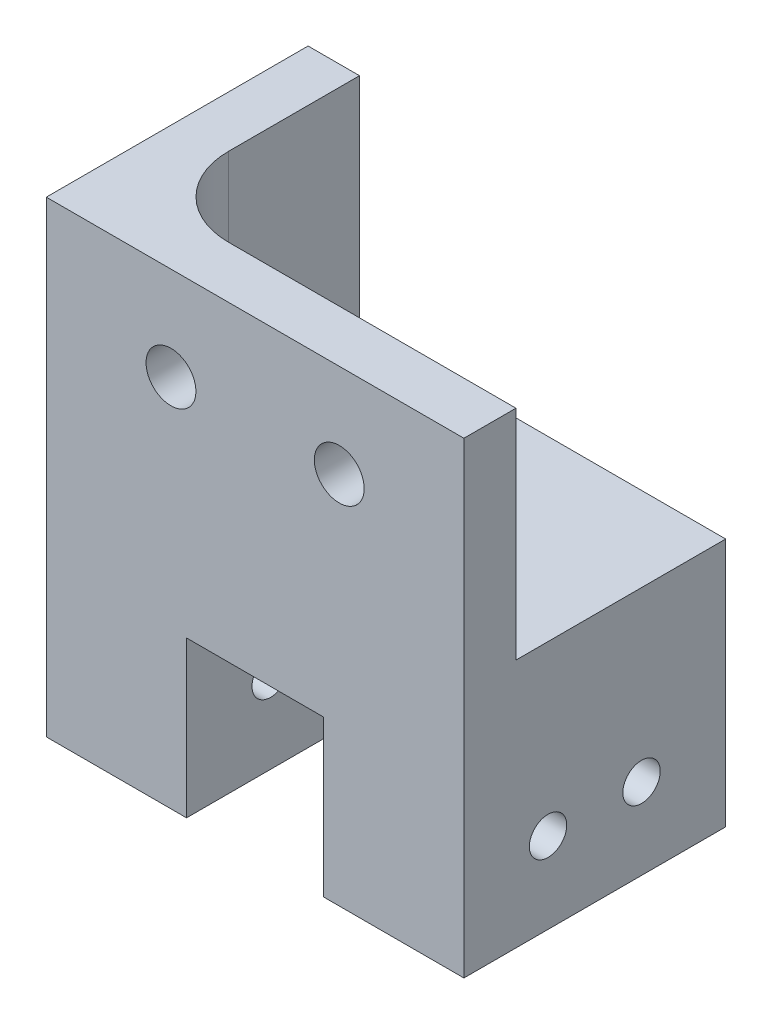
ISO-10303-21;
HEADER;
FILE_DESCRIPTION(('STEP AP214'),'2;1');
FILE_NAME('part.step','',(''),(''),'','','');
FILE_SCHEMA(('AUTOMOTIVE_DESIGN { 1 0 10303 214 1 1 1 1 }'));
ENDSEC;
DATA;
#1=APPLICATION_CONTEXT('core data for automotive mechanical design processes');
#2=APPLICATION_PROTOCOL_DEFINITION('international standard','automotive_design',2000,#1);
#3=PRODUCT_CONTEXT('',#1,'mechanical');
#4=PRODUCT('Part','Part','',(#3));
#5=PRODUCT_RELATED_PRODUCT_CATEGORY('part','',(#4));
#6=PRODUCT_DEFINITION_FORMATION('','',#4);
#7=PRODUCT_DEFINITION_CONTEXT('part definition',#1,'design');
#8=PRODUCT_DEFINITION('design','',#6,#7);
#9=PRODUCT_DEFINITION_SHAPE('','',#8);
#10=(LENGTH_UNIT() NAMED_UNIT(*) SI_UNIT(.MILLI.,.METRE.));
#11=(NAMED_UNIT(*) PLANE_ANGLE_UNIT() SI_UNIT($,.RADIAN.));
#12=(NAMED_UNIT(*) SI_UNIT($,.STERADIAN.) SOLID_ANGLE_UNIT());
#13=UNCERTAINTY_MEASURE_WITH_UNIT(LENGTH_MEASURE(1.E-05),#10,'distance_accuracy_value','');
#14=(GEOMETRIC_REPRESENTATION_CONTEXT(3) GLOBAL_UNCERTAINTY_ASSIGNED_CONTEXT((#13)) GLOBAL_UNIT_ASSIGNED_CONTEXT((#10,
#11,#12)) REPRESENTATION_CONTEXT('',''));
#15=CARTESIAN_POINT('',(0.,0.,0.));
#16=DIRECTION('',(0.,0.,1.));
#17=DIRECTION('',(1.,0.,0.));
#18=AXIS2_PLACEMENT_3D('',#15,#16,#17);
#19=CARTESIAN_POINT('',(-12.6,170.,0.));
#20=DIRECTION('',(0.,1.,0.));
#21=DIRECTION('',(0.,0.,1.));
#22=AXIS2_PLACEMENT_3D('',#19,#20,#21);
#23=CYLINDRICAL_SURFACE('',#22,12.65);
#24=CARTESIAN_POINT('',(-12.6,186.102564946019,12.65));
#25=CARTESIAN_POINT('',(-12.7059258484728,186.078089326506,12.6500132443944));
#26=CARTESIAN_POINT('',(-12.8128544057291,186.057960643612,12.6486700584664));
#27=CARTESIAN_POINT('',(-13.0279121061276,186.02647382208,12.643214377067));
#28=CARTESIAN_POINT('',(-13.1360411003354,186.015114607508,12.6391022214386));
#29=CARTESIAN_POINT('',(-13.3524596963604,186.001254100032,12.6280655201441));
#30=CARTESIAN_POINT('',(-13.4607482803691,185.998731490411,12.6211477875144));
#31=CARTESIAN_POINT('',(-13.6769574986534,186.002453777489,12.6045394442338));
#32=CARTESIAN_POINT('',(-13.7848781350465,186.008698623648,12.594848849567));
#33=CARTESIAN_POINT('',(-13.999582589159,186.029855441509,12.5728002811471));
#34=CARTESIAN_POINT('',(-14.106366543195,186.044766361731,12.5604426311096));
#35=CARTESIAN_POINT('',(-14.3180919009686,186.083072679909,12.5332391984799));
#36=CARTESIAN_POINT('',(-14.4230326033652,186.106471237031,12.5183924905485));
#37=CARTESIAN_POINT('',(-14.7340077138903,186.18907705202,12.4704577547125));
#38=CARTESIAN_POINT('',(-14.9363623686315,186.260711316056,12.4339575180502));
#39=CARTESIAN_POINT('',(-15.3304425253308,186.436685422464,12.3534892171499));
#40=CARTESIAN_POINT('',(-15.5218082075886,186.541751783818,12.3093663069555));
#41=CARTESIAN_POINT('',(-15.884477801978,186.781074891781,12.2175987314095));
#42=CARTESIAN_POINT('',(-16.0557731467017,186.91534403481,12.1699525761464));
#43=CARTESIAN_POINT('',(-16.3824270796203,187.217280361411,12.0725417274245));
#44=CARTESIAN_POINT('',(-16.5365572702244,187.386283777792,12.0227904885761));
#45=CARTESIAN_POINT('',(-16.814369158297,187.748972292668,11.9282512081505));
#46=CARTESIAN_POINT('',(-16.9380504378676,187.942657729858,11.8834632346964));
#47=CARTESIAN_POINT('',(-17.1507852354864,188.349457524719,11.8036345221334));
#48=CARTESIAN_POINT('',(-17.239928526003,188.562519711213,11.768568581623));
#49=CARTESIAN_POINT('',(-17.3804781645459,189.002443951098,11.7121881708818));
#50=CARTESIAN_POINT('',(-17.4319079741328,189.229297329693,11.6908651521793));
#51=CARTESIAN_POINT('',(-17.4925460311512,189.673764088484,11.6656114776155));
#52=CARTESIAN_POINT('',(-17.5043846551818,189.890958582611,11.6605979228071));
#53=CARTESIAN_POINT('',(-17.4927214725743,190.324200870436,11.6654971537105));
#54=CARTESIAN_POINT('',(-17.4692263548295,190.540248873402,11.6754071143101));
#55=CARTESIAN_POINT('',(-17.389593892478,190.95608533196,11.7082880533004));
#56=CARTESIAN_POINT('',(-17.3348037089765,191.156178374804,11.7307191780331));
#57=CARTESIAN_POINT('',(-17.1956448065292,191.5442558798,11.7859287660209));
#58=CARTESIAN_POINT('',(-17.1112706263519,191.732238098693,11.8187091396451));
#59=CARTESIAN_POINT('',(-16.9111205893576,192.100007482073,11.8932167961155));
#60=CARTESIAN_POINT('',(-16.7941104939916,192.279053590785,11.9352782985591));
#61=CARTESIAN_POINT('',(-16.5337209806312,192.615693476121,12.0236105632939));
#62=CARTESIAN_POINT('',(-16.3903302155527,192.773277970536,12.0698831325412));
#63=CARTESIAN_POINT('',(-16.0700074791917,193.073509122245,12.1659913817225));
#64=CARTESIAN_POINT('',(-15.8914650507388,193.214430119483,12.2158567895288));
#65=CARTESIAN_POINT('',(-15.5122430999914,193.464443627459,12.3117604042409));
#66=CARTESIAN_POINT('',(-15.3115640826167,193.573536863958,12.3577986983985));
#67=CARTESIAN_POINT('',(-14.9972432400225,193.711001203275,12.4212465682734));
#68=CARTESIAN_POINT('',(-14.8897772700481,193.752577677473,12.441533473042));
#69=CARTESIAN_POINT('',(-14.6712976172555,193.82639952528,12.4797631596805));
#70=CARTESIAN_POINT('',(-14.5602854551203,193.858648840477,12.4977069299779));
#71=CARTESIAN_POINT('',(-14.3355181390422,193.913476269907,12.530897421686));
#72=CARTESIAN_POINT('',(-14.2217631889474,193.936055100539,12.5461443428328));
#73=CARTESIAN_POINT('',(-13.9924180305709,193.971268338842,12.5736628138194));
#74=CARTESIAN_POINT('',(-13.8768287883629,193.983907814861,12.5859358778981));
#75=CARTESIAN_POINT('',(-13.6638971375534,193.997820271839,12.6055581219527));
#76=CARTESIAN_POINT('',(-13.5666957481128,194.000626358049,12.6133858197007));
#77=CARTESIAN_POINT('',(-13.3721997112428,193.999140278263,12.6267853877491));
#78=CARTESIAN_POINT('',(-13.2749050780369,193.994849062294,12.6323575598444));
#79=CARTESIAN_POINT('',(-13.0806955042024,193.979155540249,12.6412371055989));
#80=CARTESIAN_POINT('',(-12.983781008606,193.967746526392,12.6445423367277));
#81=CARTESIAN_POINT('',(-12.7909752062463,193.937870317064,12.6489282696862));
#82=CARTESIAN_POINT('',(-12.6950841105102,193.919401693726,12.6500085212119));
#83=CARTESIAN_POINT('',(-12.6,193.897435053981,12.65));
#84=B_SPLINE_CURVE_WITH_KNOTS('',3,(#24,#25,#26,#27,#28,#29,#30,#31,#32,#33,#34,#35,#36,#37,#38,
#39,#40,#41,#42,#43,#44,#45,#46,#47,#48,#49,#50,#51,#52,#53,#54,#55,#56,#57,#58,#59,#60,#61,#62,
#63,#64,#65,#66,#67,#68,#69,#70,#71,#72,#73,#74,#75,#76,#77,#78,#79,#80,#81,#82,#83),
.UNSPECIFIED.,.F.,.F.,(4,2,2,2,2,2,2,2,2,2,2,2,2,2,2,2,2,2,2,2,2,2,2,2,2,2,2,2,2,4),(0.,
0.326049211682668,0.652058413771442,0.977280633815239,1.30250097916391,1.62768187285088,
1.95298392586308,2.60308718939619,3.26841244865163,3.9340206879423,4.63297616265021,
5.33194122967656,6.02907713245438,6.72577897813349,7.37516201469344,8.02442213454908,
8.64763888610283,9.27097074463325,9.92214387640538,10.5735977540752,11.2690132844498,
11.9644129561714,12.3150430819319,12.6655248167978,13.0159805831368,13.3662575264323,
13.6586538737478,13.9510110847669,14.2436442289626,14.5363365921047),.UNSPECIFIED.);
#85=CARTESIAN_POINT('',(-12.6,186.102564946019,12.65));
#86=VERTEX_POINT('',#85);
#87=CARTESIAN_POINT('',(-12.6,193.897435053981,12.65));
#88=VERTEX_POINT('',#87);
#89=EDGE_CURVE('E52',#86,#88,#84,.T.);
#90=ORIENTED_EDGE('',*,*,#89,.F.);
#91=DIRECTION('',(0.,1.,0.));
#92=VECTOR('',#91,1.);
#93=CARTESIAN_POINT('',(-12.6,170.,12.65));
#94=LINE('',#93,#92);
#95=CARTESIAN_POINT('',(-12.6,170.,12.65));
#96=VERTEX_POINT('',#95);
#97=EDGE_CURVE('E137',#96,#86,#94,.T.);
#98=ORIENTED_EDGE('',*,*,#97,.F.);
#99=CARTESIAN_POINT('',(-12.6,170.,0.));
#100=DIRECTION('',(0.,1.,0.));
#101=DIRECTION('',(0.,0.,1.));
#102=AXIS2_PLACEMENT_3D('',#99,#100,#101);
#103=CIRCLE('',#102,12.65);
#104=CARTESIAN_POINT('',(-25.25,170.,0.));
#105=VERTEX_POINT('',#104);
#106=EDGE_CURVE('E238',#105,#96,#103,.T.);
#107=ORIENTED_EDGE('',*,*,#106,.F.);
#108=DIRECTION('',(0.,1.,0.));
#109=VECTOR('',#108,1.);
#110=CARTESIAN_POINT('',(-25.25,170.,0.));
#111=LINE('',#110,#109);
#112=CARTESIAN_POINT('',(-25.25,205.,0.));
#113=VERTEX_POINT('',#112);
#114=EDGE_CURVE('E160',#105,#113,#111,.T.);
#115=ORIENTED_EDGE('',*,*,#114,.T.);
#116=CARTESIAN_POINT('',(-12.6,205.,0.));
#117=DIRECTION('',(0.,1.,0.));
#118=DIRECTION('',(0.,0.,1.));
#119=AXIS2_PLACEMENT_3D('',#116,#117,#118);
#120=CIRCLE('',#119,12.65);
#121=CARTESIAN_POINT('',(-12.6,205.,12.65));
#122=VERTEX_POINT('',#121);
#123=EDGE_CURVE('E141',#113,#122,#120,.T.);
#124=ORIENTED_EDGE('',*,*,#123,.T.);
#125=EDGE_CURVE('E140',#88,#122,#94,.T.);
#126=ORIENTED_EDGE('',*,*,#125,.F.);
#127=EDGE_LOOP('',(#90,#98,#107,#115,#124,#126));
#128=FACE_BOUND('',#127,.T.);
#129=ADVANCED_FACE('F39',(#128),#23,.F.);
#130=CARTESIAN_POINT('',(0.,205.,-21.));
#131=DIRECTION('',(0.,1.,0.));
#132=DIRECTION('',(0.,0.,1.));
#133=AXIS2_PLACEMENT_3D('',#130,#131,#132);
#134=PLANE('',#133);
#135=DIRECTION('',(0.,0.,1.));
#136=VECTOR('',#135,1.);
#137=CARTESIAN_POINT('',(-25.25,205.,0.));
#138=LINE('',#137,#136);
#139=CARTESIAN_POINT('',(-25.25,205.,-21.));
#140=VERTEX_POINT('',#139);
#141=EDGE_CURVE('E335',#140,#113,#138,.T.);
#142=ORIENTED_EDGE('',*,*,#141,.F.);
#143=DIRECTION('',(-1.,0.,0.));
#144=VECTOR('',#143,1.);
#145=CARTESIAN_POINT('',(0.,205.,-21.));
#146=LINE('',#145,#144);
#147=CARTESIAN_POINT('',(-33.5,205.,-21.));
#148=VERTEX_POINT('',#147);
#149=EDGE_CURVE('E181',#140,#148,#146,.T.);
#150=ORIENTED_EDGE('',*,*,#149,.T.);
#151=DIRECTION('',(0.,0.,1.));
#152=VECTOR('',#151,1.);
#153=CARTESIAN_POINT('',(-33.5,205.,-21.));
#154=LINE('',#153,#152);
#155=CARTESIAN_POINT('',(-33.5,205.,21.));
#156=VERTEX_POINT('',#155);
#157=EDGE_CURVE('E203',#148,#156,#154,.T.);
#158=ORIENTED_EDGE('',*,*,#157,.T.);
#159=DIRECTION('',(-1.,0.,0.));
#160=VECTOR('',#159,1.);
#161=CARTESIAN_POINT('',(0.,205.,21.));
#162=LINE('',#161,#160);
#163=CARTESIAN_POINT('',(33.5,205.,21.));
#164=VERTEX_POINT('',#163);
#165=EDGE_CURVE('E156',#164,#156,#162,.T.);
#166=ORIENTED_EDGE('',*,*,#165,.F.);
#167=DIRECTION('',(0.,0.,1.));
#168=VECTOR('',#167,1.);
#169=CARTESIAN_POINT('',(33.5,205.,-21.));
#170=LINE('',#169,#168);
#171=CARTESIAN_POINT('',(33.5,205.,12.65));
#172=VERTEX_POINT('',#171);
#173=EDGE_CURVE('E47',#172,#164,#170,.T.);
#174=ORIENTED_EDGE('',*,*,#173,.F.);
#175=DIRECTION('',(1.,0.,0.));
#176=VECTOR('',#175,1.);
#177=CARTESIAN_POINT('',(33.5,205.,12.65));
#178=LINE('',#177,#176);
#179=EDGE_CURVE('E333',#122,#172,#178,.T.);
#180=ORIENTED_EDGE('',*,*,#179,.F.);
#181=ORIENTED_EDGE('',*,*,#123,.F.);
#182=EDGE_LOOP('',(#142,#150,#158,#166,#174,#180,#181));
#183=FACE_BOUND('',#182,.T.);
#184=ADVANCED_FACE('F265',(#183),#134,.T.);
#185=CARTESIAN_POINT('',(33.5,205.,-21.));
#186=DIRECTION('',(1.,0.,0.));
#187=DIRECTION('',(0.,0.,-1.));
#188=AXIS2_PLACEMENT_3D('',#185,#186,#187);
#189=PLANE('',#188);
#190=CARTESIAN_POINT('',(33.5,143.,-7.5));
#191=DIRECTION('',(1.,0.,0.));
#192=DIRECTION('',(0.,0.,-1.));
#193=AXIS2_PLACEMENT_3D('',#190,#191,#192);
#194=CIRCLE('',#193,3.);
#195=CARTESIAN_POINT('',(33.5,143.,-10.5));
#196=VERTEX_POINT('',#195);
#197=EDGE_CURVE('E432',#196,#196,#194,.T.);
#198=ORIENTED_EDGE('',*,*,#197,.F.);
#199=EDGE_LOOP('',(#198));
#200=FACE_BOUND('',#199,.T.);
#201=CARTESIAN_POINT('',(33.5,143.,7.5));
#202=DIRECTION('',(1.,0.,0.));
#203=DIRECTION('',(0.,0.,-1.));
#204=AXIS2_PLACEMENT_3D('',#201,#202,#203);
#205=CIRCLE('',#204,3.);
#206=CARTESIAN_POINT('',(33.5,143.,4.5));
#207=VERTEX_POINT('',#206);
#208=EDGE_CURVE('E434',#207,#207,#205,.T.);
#209=ORIENTED_EDGE('',*,*,#208,.F.);
#210=EDGE_LOOP('',(#209));
#211=FACE_BOUND('',#210,.T.);
#212=DIRECTION('',(0.,1.,0.));
#213=VECTOR('',#212,1.);
#214=CARTESIAN_POINT('',(33.5,170.,12.65));
#215=LINE('',#214,#213);
#216=CARTESIAN_POINT('',(33.5,170.,12.65));
#217=VERTEX_POINT('',#216);
#218=EDGE_CURVE('E148',#217,#172,#215,.T.);
#219=ORIENTED_EDGE('',*,*,#218,.T.);
#220=ORIENTED_EDGE('',*,*,#173,.T.);
#221=DIRECTION('',(0.,1.,0.));
#222=VECTOR('',#221,1.);
#223=CARTESIAN_POINT('',(33.5,205.,21.));
#224=LINE('',#223,#222);
#225=CARTESIAN_POINT('',(33.5,130.,21.));
#226=VERTEX_POINT('',#225);
#227=EDGE_CURVE('E178',#226,#164,#224,.T.);
#228=ORIENTED_EDGE('',*,*,#227,.F.);
#229=DIRECTION('',(0.,0.,1.));
#230=VECTOR('',#229,1.);
#231=CARTESIAN_POINT('',(33.5,130.,-21.));
#232=LINE('',#231,#230);
#233=CARTESIAN_POINT('',(33.5,130.,-21.));
#234=VERTEX_POINT('',#233);
#235=EDGE_CURVE('E205',#234,#226,#232,.T.);
#236=ORIENTED_EDGE('',*,*,#235,.F.);
#237=DIRECTION('',(0.,1.,0.));
#238=VECTOR('',#237,1.);
#239=CARTESIAN_POINT('',(33.5,205.,-21.));
#240=LINE('',#239,#238);
#241=CARTESIAN_POINT('',(33.5,170.,-21.));
#242=VERTEX_POINT('',#241);
#243=EDGE_CURVE('E200',#234,#242,#240,.T.);
#244=ORIENTED_EDGE('',*,*,#243,.T.);
#245=DIRECTION('',(0.,0.,-1.));
#246=VECTOR('',#245,1.);
#247=CARTESIAN_POINT('',(33.5,170.,-21.));
#248=LINE('',#247,#246);
#249=EDGE_CURVE('E60',#217,#242,#248,.T.);
#250=ORIENTED_EDGE('',*,*,#249,.F.);
#251=EDGE_LOOP('',(#219,#220,#228,#236,#244,#250));
#252=FACE_BOUND('',#251,.T.);
#253=ADVANCED_FACE('F269',(#200,#211,#252),#189,.T.);
#254=CARTESIAN_POINT('',(33.5,130.,-21.));
#255=DIRECTION('',(0.,-1.,0.));
#256=DIRECTION('',(1.,0.,0.));
#257=AXIS2_PLACEMENT_3D('',#254,#255,#256);
#258=PLANE('',#257);
#259=ORIENTED_EDGE('',*,*,#235,.T.);
#260=DIRECTION('',(1.,0.,0.));
#261=VECTOR('',#260,1.);
#262=CARTESIAN_POINT('',(33.5,130.,21.));
#263=LINE('',#262,#261);
#264=CARTESIAN_POINT('',(11.,130.,21.));
#265=VERTEX_POINT('',#264);
#266=EDGE_CURVE('E175',#265,#226,#263,.T.);
#267=ORIENTED_EDGE('',*,*,#266,.F.);
#268=DIRECTION('',(0.,0.,1.));
#269=VECTOR('',#268,1.);
#270=CARTESIAN_POINT('',(11.,130.,-21.));
#271=LINE('',#270,#269);
#272=CARTESIAN_POINT('',(11.,130.,-21.));
#273=VERTEX_POINT('',#272);
#274=EDGE_CURVE('E207',#273,#265,#271,.T.);
#275=ORIENTED_EDGE('',*,*,#274,.F.);
#276=DIRECTION('',(1.,0.,0.));
#277=VECTOR('',#276,1.);
#278=CARTESIAN_POINT('',(33.5,130.,-21.));
#279=LINE('',#278,#277);
#280=EDGE_CURVE('E197',#273,#234,#279,.T.);
#281=ORIENTED_EDGE('',*,*,#280,.T.);
#282=EDGE_LOOP('',(#259,#267,#275,#281));
#283=FACE_BOUND('',#282,.T.);
#284=ADVANCED_FACE('F277',(#283),#258,.T.);
#285=CARTESIAN_POINT('',(11.,130.,-21.));
#286=DIRECTION('',(-1.,0.,0.));
#287=DIRECTION('',(0.,0.,1.));
#288=AXIS2_PLACEMENT_3D('',#285,#286,#287);
#289=PLANE('',#288);
#290=CARTESIAN_POINT('',(11.,143.,-7.5));
#291=DIRECTION('',(-1.,0.,0.));
#292=DIRECTION('',(0.,0.,1.));
#293=AXIS2_PLACEMENT_3D('',#290,#291,#292);
#294=CIRCLE('',#293,3.);
#295=CARTESIAN_POINT('',(11.,143.,-4.5));
#296=VERTEX_POINT('',#295);
#297=EDGE_CURVE('E227',#296,#296,#294,.T.);
#298=ORIENTED_EDGE('',*,*,#297,.F.);
#299=EDGE_LOOP('',(#298));
#300=FACE_BOUND('',#299,.T.);
#301=CARTESIAN_POINT('',(11.,143.,7.5));
#302=DIRECTION('',(-1.,0.,0.));
#303=DIRECTION('',(0.,0.,1.));
#304=AXIS2_PLACEMENT_3D('',#301,#302,#303);
#305=CIRCLE('',#304,3.);
#306=CARTESIAN_POINT('',(11.,143.,10.5));
#307=VERTEX_POINT('',#306);
#308=EDGE_CURVE('E447',#307,#307,#305,.T.);
#309=ORIENTED_EDGE('',*,*,#308,.F.);
#310=EDGE_LOOP('',(#309));
#311=FACE_BOUND('',#310,.T.);
#312=ORIENTED_EDGE('',*,*,#274,.T.);
#313=DIRECTION('',(0.,-1.,0.));
#314=VECTOR('',#313,1.);
#315=CARTESIAN_POINT('',(11.,130.,21.));
#316=LINE('',#315,#314);
#317=CARTESIAN_POINT('',(11.,155.,21.));
#318=VERTEX_POINT('',#317);
#319=EDGE_CURVE('E172',#318,#265,#316,.T.);
#320=ORIENTED_EDGE('',*,*,#319,.F.);
#321=DIRECTION('',(0.,0.,1.));
#322=VECTOR('',#321,1.);
#323=CARTESIAN_POINT('',(11.,155.,-21.));
#324=LINE('',#323,#322);
#325=CARTESIAN_POINT('',(11.,155.,-21.));
#326=VERTEX_POINT('',#325);
#327=EDGE_CURVE('E209',#326,#318,#324,.T.);
#328=ORIENTED_EDGE('',*,*,#327,.F.);
#329=DIRECTION('',(0.,-1.,0.));
#330=VECTOR('',#329,1.);
#331=CARTESIAN_POINT('',(11.,130.,-21.));
#332=LINE('',#331,#330);
#333=EDGE_CURVE('E194',#326,#273,#332,.T.);
#334=ORIENTED_EDGE('',*,*,#333,.T.);
#335=EDGE_LOOP('',(#312,#320,#328,#334));
#336=FACE_BOUND('',#335,.T.);
#337=ADVANCED_FACE('F286',(#300,#311,#336),#289,.T.);
#338=CARTESIAN_POINT('',(11.,155.,-21.));
#339=DIRECTION('',(0.,-1.,0.));
#340=DIRECTION('',(0.,0.,-1.));
#341=AXIS2_PLACEMENT_3D('',#338,#339,#340);
#342=PLANE('',#341);
#343=ORIENTED_EDGE('',*,*,#327,.T.);
#344=DIRECTION('',(1.,0.,0.));
#345=VECTOR('',#344,1.);
#346=CARTESIAN_POINT('',(-11.,155.,21.));
#347=LINE('',#346,#345);
#348=CARTESIAN_POINT('',(-11.,155.,21.));
#349=VERTEX_POINT('',#348);
#350=EDGE_CURVE('E169',#349,#318,#347,.T.);
#351=ORIENTED_EDGE('',*,*,#350,.F.);
#352=DIRECTION('',(0.,0.,1.));
#353=VECTOR('',#352,1.);
#354=CARTESIAN_POINT('',(-11.,155.,-21.));
#355=LINE('',#354,#353);
#356=CARTESIAN_POINT('',(-11.,155.,-21.));
#357=VERTEX_POINT('',#356);
#358=EDGE_CURVE('E211',#357,#349,#355,.T.);
#359=ORIENTED_EDGE('',*,*,#358,.F.);
#360=DIRECTION('',(1.,0.,0.));
#361=VECTOR('',#360,1.);
#362=CARTESIAN_POINT('',(-11.,155.,-21.));
#363=LINE('',#362,#361);
#364=EDGE_CURVE('E192',#357,#326,#363,.T.);
#365=ORIENTED_EDGE('',*,*,#364,.T.);
#366=EDGE_LOOP('',(#343,#351,#359,#365));
#367=FACE_BOUND('',#366,.T.);
#368=ADVANCED_FACE('F290',(#367),#342,.T.);
#369=CARTESIAN_POINT('',(-11.,130.,-21.));
#370=DIRECTION('',(1.,0.,0.));
#371=DIRECTION('',(0.,0.,-1.));
#372=AXIS2_PLACEMENT_3D('',#369,#370,#371);
#373=PLANE('',#372);
#374=CARTESIAN_POINT('',(-11.,143.,-7.5));
#375=DIRECTION('',(1.,0.,0.));
#376=DIRECTION('',(0.,0.,-1.));
#377=AXIS2_PLACEMENT_3D('',#374,#375,#376);
#378=CIRCLE('',#377,3.);
#379=CARTESIAN_POINT('',(-11.,143.,-10.5));
#380=VERTEX_POINT('',#379);
#381=EDGE_CURVE('E449',#380,#380,#378,.T.);
#382=ORIENTED_EDGE('',*,*,#381,.F.);
#383=EDGE_LOOP('',(#382));
#384=FACE_BOUND('',#383,.T.);
#385=CARTESIAN_POINT('',(-11.,143.,7.5));
#386=DIRECTION('',(1.,0.,0.));
#387=DIRECTION('',(0.,0.,-1.));
#388=AXIS2_PLACEMENT_3D('',#385,#386,#387);
#389=CIRCLE('',#388,3.);
#390=CARTESIAN_POINT('',(-11.,143.,4.5));
#391=VERTEX_POINT('',#390);
#392=EDGE_CURVE('E437',#391,#391,#389,.T.);
#393=ORIENTED_EDGE('',*,*,#392,.F.);
#394=EDGE_LOOP('',(#393));
#395=FACE_BOUND('',#394,.T.);
#396=ORIENTED_EDGE('',*,*,#358,.T.);
#397=DIRECTION('',(0.,1.,0.));
#398=VECTOR('',#397,1.);
#399=CARTESIAN_POINT('',(-11.,130.,21.));
#400=LINE('',#399,#398);
#401=CARTESIAN_POINT('',(-11.,130.,21.));
#402=VERTEX_POINT('',#401);
#403=EDGE_CURVE('E166',#402,#349,#400,.T.);
#404=ORIENTED_EDGE('',*,*,#403,.F.);
#405=DIRECTION('',(0.,0.,1.));
#406=VECTOR('',#405,1.);
#407=CARTESIAN_POINT('',(-11.,130.,-21.));
#408=LINE('',#407,#406);
#409=CARTESIAN_POINT('',(-11.,130.,-21.));
#410=VERTEX_POINT('',#409);
#411=EDGE_CURVE('E213',#410,#402,#408,.T.);
#412=ORIENTED_EDGE('',*,*,#411,.F.);
#413=DIRECTION('',(0.,1.,0.));
#414=VECTOR('',#413,1.);
#415=CARTESIAN_POINT('',(-11.,130.,-21.));
#416=LINE('',#415,#414);
#417=EDGE_CURVE('E189',#410,#357,#416,.T.);
#418=ORIENTED_EDGE('',*,*,#417,.T.);
#419=EDGE_LOOP('',(#396,#404,#412,#418));
#420=FACE_BOUND('',#419,.T.);
#421=ADVANCED_FACE('F294',(#384,#395,#420),#373,.T.);
#422=CARTESIAN_POINT('',(-33.5,130.,-21.));
#423=DIRECTION('',(0.,-1.,0.));
#424=DIRECTION('',(1.,0.,0.));
#425=AXIS2_PLACEMENT_3D('',#422,#423,#424);
#426=PLANE('',#425);
#427=ORIENTED_EDGE('',*,*,#411,.T.);
#428=DIRECTION('',(1.,0.,0.));
#429=VECTOR('',#428,1.);
#430=CARTESIAN_POINT('',(-33.5,130.,21.));
#431=LINE('',#430,#429);
#432=CARTESIAN_POINT('',(-33.5,130.,21.));
#433=VERTEX_POINT('',#432);
#434=EDGE_CURVE('E163',#433,#402,#431,.T.);
#435=ORIENTED_EDGE('',*,*,#434,.F.);
#436=DIRECTION('',(0.,0.,1.));
#437=VECTOR('',#436,1.);
#438=CARTESIAN_POINT('',(-33.5,130.,-21.));
#439=LINE('',#438,#437);
#440=CARTESIAN_POINT('',(-33.5,130.,-21.));
#441=VERTEX_POINT('',#440);
#442=EDGE_CURVE('E215',#441,#433,#439,.T.);
#443=ORIENTED_EDGE('',*,*,#442,.F.);
#444=DIRECTION('',(1.,0.,0.));
#445=VECTOR('',#444,1.);
#446=CARTESIAN_POINT('',(-33.5,130.,-21.));
#447=LINE('',#446,#445);
#448=EDGE_CURVE('E186',#441,#410,#447,.T.);
#449=ORIENTED_EDGE('',*,*,#448,.T.);
#450=EDGE_LOOP('',(#427,#435,#443,#449));
#451=FACE_BOUND('',#450,.T.);
#452=ADVANCED_FACE('F297',(#451),#426,.T.);
#453=CARTESIAN_POINT('',(-33.5,205.,-21.));
#454=DIRECTION('',(-1.,0.,0.));
#455=DIRECTION('',(0.,0.,1.));
#456=AXIS2_PLACEMENT_3D('',#453,#454,#455);
#457=PLANE('',#456);
#458=CARTESIAN_POINT('',(-33.5,143.,-7.5));
#459=DIRECTION('',(-1.,0.,0.));
#460=DIRECTION('',(0.,0.,1.));
#461=AXIS2_PLACEMENT_3D('',#458,#459,#460);
#462=CIRCLE('',#461,3.);
#463=CARTESIAN_POINT('',(-33.5,143.,-4.5));
#464=VERTEX_POINT('',#463);
#465=EDGE_CURVE('E433',#464,#464,#462,.F.);
#466=ORIENTED_EDGE('',*,*,#465,.T.);
#467=EDGE_LOOP('',(#466));
#468=FACE_BOUND('',#467,.T.);
#469=CARTESIAN_POINT('',(-33.5,143.,7.5));
#470=DIRECTION('',(-1.,0.,0.));
#471=DIRECTION('',(0.,0.,1.));
#472=AXIS2_PLACEMENT_3D('',#469,#470,#471);
#473=CIRCLE('',#472,3.);
#474=CARTESIAN_POINT('',(-33.5,143.,10.5));
#475=VERTEX_POINT('',#474);
#476=EDGE_CURVE('E440',#475,#475,#473,.F.);
#477=ORIENTED_EDGE('',*,*,#476,.T.);
#478=EDGE_LOOP('',(#477));
#479=FACE_BOUND('',#478,.T.);
#480=ORIENTED_EDGE('',*,*,#442,.T.);
#481=DIRECTION('',(0.,-1.,0.));
#482=VECTOR('',#481,1.);
#483=CARTESIAN_POINT('',(-33.5,205.,21.));
#484=LINE('',#483,#482);
#485=EDGE_CURVE('E159',#156,#433,#484,.T.);
#486=ORIENTED_EDGE('',*,*,#485,.F.);
#487=ORIENTED_EDGE('',*,*,#157,.F.);
#488=DIRECTION('',(0.,-1.,0.));
#489=VECTOR('',#488,1.);
#490=CARTESIAN_POINT('',(-33.5,205.,-21.));
#491=LINE('',#490,#489);
#492=EDGE_CURVE('E183',#148,#441,#491,.T.);
#493=ORIENTED_EDGE('',*,*,#492,.T.);
#494=EDGE_LOOP('',(#480,#486,#487,#493));
#495=FACE_BOUND('',#494,.T.);
#496=ADVANCED_FACE('F41',(#468,#479,#495),#457,.T.);
#497=CARTESIAN_POINT('',(0.,0.,-21.));
#498=DIRECTION('',(0.,0.,1.));
#499=DIRECTION('',(1.,0.,0.));
#500=AXIS2_PLACEMENT_3D('',#497,#498,#499);
#501=PLANE('',#500);
#502=ORIENTED_EDGE('',*,*,#149,.F.);
#503=DIRECTION('',(0.,1.,0.));
#504=VECTOR('',#503,1.);
#505=CARTESIAN_POINT('',(-25.25,170.,-21.));
#506=LINE('',#505,#504);
#507=CARTESIAN_POINT('',(-25.25,170.,-21.));
#508=VERTEX_POINT('',#507);
#509=EDGE_CURVE('E151',#508,#140,#506,.T.);
#510=ORIENTED_EDGE('',*,*,#509,.F.);
#511=DIRECTION('',(-1.,0.,0.));
#512=VECTOR('',#511,1.);
#513=CARTESIAN_POINT('',(-25.25,170.,-21.));
#514=LINE('',#513,#512);
#515=EDGE_CURVE('E325',#242,#508,#514,.T.);
#516=ORIENTED_EDGE('',*,*,#515,.F.);
#517=ORIENTED_EDGE('',*,*,#243,.F.);
#518=ORIENTED_EDGE('',*,*,#280,.F.);
#519=ORIENTED_EDGE('',*,*,#333,.F.);
#520=ORIENTED_EDGE('',*,*,#364,.F.);
#521=ORIENTED_EDGE('',*,*,#417,.F.);
#522=ORIENTED_EDGE('',*,*,#448,.F.);
#523=ORIENTED_EDGE('',*,*,#492,.F.);
#524=EDGE_LOOP('',(#502,#510,#516,#517,#518,#519,#520,#521,#522,#523));
#525=FACE_BOUND('',#524,.T.);
#526=ADVANCED_FACE('F282',(#525),#501,.F.);
#527=CARTESIAN_POINT('',(0.,0.,21.));
#528=DIRECTION('',(0.,0.,1.));
#529=DIRECTION('',(1.,0.,0.));
#530=AXIS2_PLACEMENT_3D('',#527,#528,#529);
#531=PLANE('',#530);
#532=CARTESIAN_POINT('',(-13.5,190.,21.));
#533=DIRECTION('',(0.,0.,1.));
#534=DIRECTION('',(1.,0.,0.));
#535=AXIS2_PLACEMENT_3D('',#532,#533,#534);
#536=CIRCLE('',#535,4.);
#537=CARTESIAN_POINT('',(-9.5,190.,21.));
#538=VERTEX_POINT('',#537);
#539=EDGE_CURVE('E218',#538,#538,#536,.T.);
#540=ORIENTED_EDGE('',*,*,#539,.F.);
#541=EDGE_LOOP('',(#540));
#542=FACE_BOUND('',#541,.T.);
#543=CARTESIAN_POINT('',(13.5,190.,21.));
#544=DIRECTION('',(0.,0.,1.));
#545=DIRECTION('',(1.,0.,0.));
#546=AXIS2_PLACEMENT_3D('',#543,#544,#545);
#547=CIRCLE('',#546,4.);
#548=CARTESIAN_POINT('',(17.5,190.,21.));
#549=VERTEX_POINT('',#548);
#550=EDGE_CURVE('E222',#549,#549,#547,.T.);
#551=ORIENTED_EDGE('',*,*,#550,.F.);
#552=EDGE_LOOP('',(#551));
#553=FACE_BOUND('',#552,.T.);
#554=ORIENTED_EDGE('',*,*,#165,.T.);
#555=ORIENTED_EDGE('',*,*,#485,.T.);
#556=ORIENTED_EDGE('',*,*,#434,.T.);
#557=ORIENTED_EDGE('',*,*,#403,.T.);
#558=ORIENTED_EDGE('',*,*,#350,.T.);
#559=ORIENTED_EDGE('',*,*,#319,.T.);
#560=ORIENTED_EDGE('',*,*,#266,.T.);
#561=ORIENTED_EDGE('',*,*,#227,.T.);
#562=EDGE_LOOP('',(#554,#555,#556,#557,#558,#559,#560,#561));
#563=FACE_BOUND('',#562,.T.);
#564=ADVANCED_FACE('F258',(#542,#553,#563),#531,.T.);
#565=CARTESIAN_POINT('',(-25.25,170.,0.));
#566=DIRECTION('',(-1.,0.,0.));
#567=DIRECTION('',(0.,0.,1.));
#568=AXIS2_PLACEMENT_3D('',#565,#566,#567);
#569=PLANE('',#568);
#570=ORIENTED_EDGE('',*,*,#141,.T.);
#571=ORIENTED_EDGE('',*,*,#114,.F.);
#572=DIRECTION('',(0.,0.,1.));
#573=VECTOR('',#572,1.);
#574=CARTESIAN_POINT('',(-25.25,170.,0.));
#575=LINE('',#574,#573);
#576=EDGE_CURVE('E153',#508,#105,#575,.T.);
#577=ORIENTED_EDGE('',*,*,#576,.F.);
#578=ORIENTED_EDGE('',*,*,#509,.T.);
#579=EDGE_LOOP('',(#570,#571,#577,#578));
#580=FACE_BOUND('',#579,.T.);
#581=ADVANCED_FACE('F256',(#580),#569,.F.);
#582=CARTESIAN_POINT('',(33.5,170.,12.65));
#583=DIRECTION('',(0.,0.,1.));
#584=DIRECTION('',(1.,0.,0.));
#585=AXIS2_PLACEMENT_3D('',#582,#583,#584);
#586=PLANE('',#585);
#587=CARTESIAN_POINT('',(-13.5,190.,12.65));
#588=DIRECTION('',(0.,0.,1.));
#589=DIRECTION('',(1.,0.,0.));
#590=AXIS2_PLACEMENT_3D('',#587,#588,#589);
#591=CIRCLE('',#590,4.);
#592=EDGE_CURVE('E11',#88,#86,#591,.F.);
#593=ORIENTED_EDGE('',*,*,#592,.F.);
#594=ORIENTED_EDGE('',*,*,#125,.T.);
#595=ORIENTED_EDGE('',*,*,#179,.T.);
#596=ORIENTED_EDGE('',*,*,#218,.F.);
#597=DIRECTION('',(1.,0.,0.));
#598=VECTOR('',#597,1.);
#599=CARTESIAN_POINT('',(33.5,170.,12.65));
#600=LINE('',#599,#598);
#601=EDGE_CURVE('E146',#96,#217,#600,.T.);
#602=ORIENTED_EDGE('',*,*,#601,.F.);
#603=ORIENTED_EDGE('',*,*,#97,.T.);
#604=EDGE_LOOP('',(#593,#594,#595,#596,#602,#603));
#605=FACE_BOUND('',#604,.T.);
#606=CARTESIAN_POINT('',(13.5,190.,12.65));
#607=DIRECTION('',(0.,0.,1.));
#608=DIRECTION('',(1.,0.,0.));
#609=AXIS2_PLACEMENT_3D('',#606,#607,#608);
#610=CIRCLE('',#609,4.);
#611=CARTESIAN_POINT('',(17.5,190.,12.65));
#612=VERTEX_POINT('',#611);
#613=EDGE_CURVE('E142',#612,#612,#610,.F.);
#614=ORIENTED_EDGE('',*,*,#613,.F.);
#615=EDGE_LOOP('',(#614));
#616=FACE_BOUND('',#615,.T.);
#617=ADVANCED_FACE('F144',(#605,#616),#586,.F.);
#618=CARTESIAN_POINT('',(-12.6,170.,0.));
#619=DIRECTION('',(0.,1.,0.));
#620=DIRECTION('',(0.,0.,1.));
#621=AXIS2_PLACEMENT_3D('',#618,#619,#620);
#622=PLANE('',#621);
#623=ORIENTED_EDGE('',*,*,#106,.T.);
#624=ORIENTED_EDGE('',*,*,#601,.T.);
#625=ORIENTED_EDGE('',*,*,#249,.T.);
#626=ORIENTED_EDGE('',*,*,#515,.T.);
#627=ORIENTED_EDGE('',*,*,#576,.T.);
#628=EDGE_LOOP('',(#623,#624,#625,#626,#627));
#629=FACE_BOUND('',#628,.T.);
#630=ADVANCED_FACE('F252',(#629),#622,.T.);
#631=CARTESIAN_POINT('',(13.5,190.,32.3137084989848));
#632=DIRECTION('',(0.,0.,-1.));
#633=DIRECTION('',(-1.,0.,0.));
#634=AXIS2_PLACEMENT_3D('',#631,#632,#633);
#635=CYLINDRICAL_SURFACE('',#634,4.);
#636=ORIENTED_EDGE('',*,*,#550,.T.);
#637=EDGE_LOOP('',(#636));
#638=FACE_BOUND('',#637,.T.);
#639=ORIENTED_EDGE('',*,*,#613,.T.);
#640=EDGE_LOOP('',(#639));
#641=FACE_BOUND('',#640,.T.);
#642=ADVANCED_FACE('F248',(#638,#641),#635,.F.);
#643=CARTESIAN_POINT('',(-13.5,190.,32.3137084989848));
#644=DIRECTION('',(0.,0.,-1.));
#645=DIRECTION('',(-1.,0.,0.));
#646=AXIS2_PLACEMENT_3D('',#643,#644,#645);
#647=CYLINDRICAL_SURFACE('',#646,4.);
#648=ORIENTED_EDGE('',*,*,#539,.T.);
#649=EDGE_LOOP('',(#648));
#650=FACE_BOUND('',#649,.T.);
#651=ORIENTED_EDGE('',*,*,#89,.T.);
#652=ORIENTED_EDGE('',*,*,#592,.T.);
#653=EDGE_LOOP('',(#651,#652));
#654=FACE_BOUND('',#653,.T.);
#655=ADVANCED_FACE('F131',(#650,#654),#647,.F.);
#656=CARTESIAN_POINT('',(-41.9852813742386,143.,7.5));
#657=DIRECTION('',(1.,0.,0.));
#658=DIRECTION('',(0.,0.,-1.));
#659=AXIS2_PLACEMENT_3D('',#656,#657,#658);
#660=CYLINDRICAL_SURFACE('',#659,3.);
#661=ORIENTED_EDGE('',*,*,#392,.T.);
#662=EDGE_LOOP('',(#661));
#663=FACE_BOUND('',#662,.T.);
#664=ORIENTED_EDGE('',*,*,#476,.F.);
#665=EDGE_LOOP('',(#664));
#666=FACE_BOUND('',#665,.T.);
#667=ADVANCED_FACE('F247',(#663,#666),#660,.F.);
#668=CARTESIAN_POINT('',(-41.9852813742386,143.,-7.5));
#669=DIRECTION('',(1.,0.,0.));
#670=DIRECTION('',(0.,0.,-1.));
#671=AXIS2_PLACEMENT_3D('',#668,#669,#670);
#672=CYLINDRICAL_SURFACE('',#671,3.);
#673=ORIENTED_EDGE('',*,*,#381,.T.);
#674=EDGE_LOOP('',(#673));
#675=FACE_BOUND('',#674,.T.);
#676=ORIENTED_EDGE('',*,*,#465,.F.);
#677=EDGE_LOOP('',(#676));
#678=FACE_BOUND('',#677,.T.);
#679=ADVANCED_FACE('F398',(#675,#678),#672,.F.);
#680=ORIENTED_EDGE('',*,*,#308,.T.);
#681=EDGE_LOOP('',(#680));
#682=FACE_BOUND('',#681,.T.);
#683=ORIENTED_EDGE('',*,*,#208,.T.);
#684=EDGE_LOOP('',(#683));
#685=FACE_BOUND('',#684,.T.);
#686=ADVANCED_FACE('F400',(#682,#685),#660,.F.);
#687=ORIENTED_EDGE('',*,*,#297,.T.);
#688=EDGE_LOOP('',(#687));
#689=FACE_BOUND('',#688,.T.);
#690=ORIENTED_EDGE('',*,*,#197,.T.);
#691=EDGE_LOOP('',(#690));
#692=FACE_BOUND('',#691,.T.);
#693=ADVANCED_FACE('F409',(#689,#692),#672,.F.);
#694=CLOSED_SHELL('',(#129,#184,#253,#284,#337,#368,#421,#452,#496,#526,#564,#581,#617,#630,
#642,#655,#667,#679,#686,#693));
#695=MANIFOLD_SOLID_BREP('B2',#694);
#696=ADVANCED_BREP_SHAPE_REPRESENTATION('',(#18,#695),#14);
#697=SHAPE_DEFINITION_REPRESENTATION(#9,#696);
ENDSEC;
END-ISO-10303-21;
